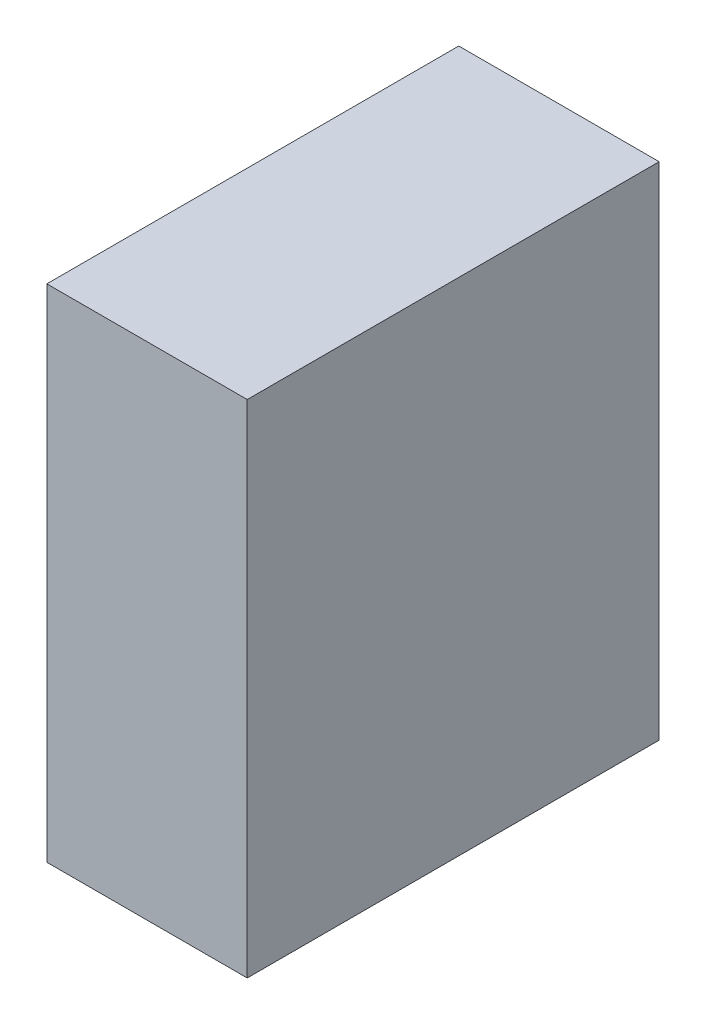
ISO-10303-21;
HEADER;
FILE_DESCRIPTION(('STEP AP214'),'2;1');
FILE_NAME('part.step','',(''),(''),'','','');
FILE_SCHEMA(('AUTOMOTIVE_DESIGN { 1 0 10303 214 1 1 1 1 }'));
ENDSEC;
DATA;
#1=APPLICATION_CONTEXT('core data for automotive mechanical design processes');
#2=APPLICATION_PROTOCOL_DEFINITION('international standard','automotive_design',2000,#1);
#3=PRODUCT_CONTEXT('',#1,'mechanical');
#4=PRODUCT('Part','Part','',(#3));
#5=PRODUCT_RELATED_PRODUCT_CATEGORY('part','',(#4));
#6=PRODUCT_DEFINITION_FORMATION('','',#4);
#7=PRODUCT_DEFINITION_CONTEXT('part definition',#1,'design');
#8=PRODUCT_DEFINITION('design','',#6,#7);
#9=PRODUCT_DEFINITION_SHAPE('','',#8);
#10=(LENGTH_UNIT() NAMED_UNIT(*) SI_UNIT(.MILLI.,.METRE.));
#11=(NAMED_UNIT(*) PLANE_ANGLE_UNIT() SI_UNIT($,.RADIAN.));
#12=(NAMED_UNIT(*) SI_UNIT($,.STERADIAN.) SOLID_ANGLE_UNIT());
#13=UNCERTAINTY_MEASURE_WITH_UNIT(LENGTH_MEASURE(1.E-05),#10,'distance_accuracy_value','');
#14=(GEOMETRIC_REPRESENTATION_CONTEXT(3) GLOBAL_UNCERTAINTY_ASSIGNED_CONTEXT((#13)) GLOBAL_UNIT_ASSIGNED_CONTEXT((#10,
#11,#12)) REPRESENTATION_CONTEXT('',''));
#15=CARTESIAN_POINT('',(0.,0.,0.));
#16=DIRECTION('',(0.,0.,1.));
#17=DIRECTION('',(1.,0.,0.));
#18=AXIS2_PLACEMENT_3D('',#15,#16,#17);
#19=CARTESIAN_POINT('',(90.,450.,185.));
#20=DIRECTION('',(-1.,0.,0.));
#21=DIRECTION('',(0.,0.,1.));
#22=AXIS2_PLACEMENT_3D('',#19,#20,#21);
#23=PLANE('',#22);
#24=DIRECTION('',(0.,0.,-1.));
#25=VECTOR('',#24,1.);
#26=CARTESIAN_POINT('',(90.,0.,185.));
#27=LINE('',#26,#25);
#28=CARTESIAN_POINT('',(90.,0.,185.));
#29=VERTEX_POINT('',#28);
#30=CARTESIAN_POINT('',(90.,0.,-185.));
#31=VERTEX_POINT('',#30);
#32=EDGE_CURVE('E107',#29,#31,#27,.T.);
#33=ORIENTED_EDGE('',*,*,#32,.T.);
#34=DIRECTION('',(0.,-1.,0.));
#35=VECTOR('',#34,1.);
#36=CARTESIAN_POINT('',(90.,450.,-185.));
#37=LINE('',#36,#35);
#38=CARTESIAN_POINT('',(90.,450.,-185.));
#39=VERTEX_POINT('',#38);
#40=EDGE_CURVE('E11',#39,#31,#37,.T.);
#41=ORIENTED_EDGE('',*,*,#40,.F.);
#42=DIRECTION('',(0.,0.,-1.));
#43=VECTOR('',#42,1.);
#44=CARTESIAN_POINT('',(90.,450.,185.));
#45=LINE('',#44,#43);
#46=CARTESIAN_POINT('',(90.,450.,185.));
#47=VERTEX_POINT('',#46);
#48=EDGE_CURVE('E91',#47,#39,#45,.T.);
#49=ORIENTED_EDGE('',*,*,#48,.F.);
#50=DIRECTION('',(0.,-1.,0.));
#51=VECTOR('',#50,1.);
#52=CARTESIAN_POINT('',(90.,450.,185.));
#53=LINE('',#52,#51);
#54=EDGE_CURVE('E103',#47,#29,#53,.T.);
#55=ORIENTED_EDGE('',*,*,#54,.T.);
#56=EDGE_LOOP('',(#33,#41,#49,#55));
#57=FACE_BOUND('',#56,.T.);
#58=ADVANCED_FACE('F39',(#57),#23,.F.);
#59=CARTESIAN_POINT('',(-90.,450.,-185.));
#60=DIRECTION('',(0.,0.,1.));
#61=DIRECTION('',(1.,0.,0.));
#62=AXIS2_PLACEMENT_3D('',#59,#60,#61);
#63=PLANE('',#62);
#64=DIRECTION('',(-1.,0.,0.));
#65=VECTOR('',#64,1.);
#66=CARTESIAN_POINT('',(-90.,0.,-185.));
#67=LINE('',#66,#65);
#68=CARTESIAN_POINT('',(-90.,0.,-185.));
#69=VERTEX_POINT('',#68);
#70=EDGE_CURVE('E96',#31,#69,#67,.T.);
#71=ORIENTED_EDGE('',*,*,#70,.T.);
#72=DIRECTION('',(0.,-1.,0.));
#73=VECTOR('',#72,1.);
#74=CARTESIAN_POINT('',(-90.,450.,-185.));
#75=LINE('',#74,#73);
#76=CARTESIAN_POINT('',(-90.,450.,-185.));
#77=VERTEX_POINT('',#76);
#78=EDGE_CURVE('E48',#77,#69,#75,.T.);
#79=ORIENTED_EDGE('',*,*,#78,.F.);
#80=DIRECTION('',(-1.,0.,0.));
#81=VECTOR('',#80,1.);
#82=CARTESIAN_POINT('',(-90.,450.,-185.));
#83=LINE('',#82,#81);
#84=EDGE_CURVE('E86',#39,#77,#83,.T.);
#85=ORIENTED_EDGE('',*,*,#84,.F.);
#86=ORIENTED_EDGE('',*,*,#40,.T.);
#87=EDGE_LOOP('',(#71,#79,#85,#86));
#88=FACE_BOUND('',#87,.T.);
#89=ADVANCED_FACE('F95',(#88),#63,.F.);
#90=CARTESIAN_POINT('',(-90.,450.,185.));
#91=DIRECTION('',(1.,0.,0.));
#92=DIRECTION('',(0.,0.,-1.));
#93=AXIS2_PLACEMENT_3D('',#90,#91,#92);
#94=PLANE('',#93);
#95=DIRECTION('',(0.,0.,1.));
#96=VECTOR('',#95,1.);
#97=CARTESIAN_POINT('',(-90.,0.,185.));
#98=LINE('',#97,#96);
#99=CARTESIAN_POINT('',(-90.,0.,185.));
#100=VERTEX_POINT('',#99);
#101=EDGE_CURVE('E73',#69,#100,#98,.T.);
#102=ORIENTED_EDGE('',*,*,#101,.T.);
#103=DIRECTION('',(0.,-1.,0.));
#104=VECTOR('',#103,1.);
#105=CARTESIAN_POINT('',(-90.,450.,185.));
#106=LINE('',#105,#104);
#107=CARTESIAN_POINT('',(-90.,450.,185.));
#108=VERTEX_POINT('',#107);
#109=EDGE_CURVE('E98',#108,#100,#106,.T.);
#110=ORIENTED_EDGE('',*,*,#109,.F.);
#111=DIRECTION('',(0.,0.,1.));
#112=VECTOR('',#111,1.);
#113=CARTESIAN_POINT('',(-90.,450.,185.));
#114=LINE('',#113,#112);
#115=EDGE_CURVE('E89',#77,#108,#114,.T.);
#116=ORIENTED_EDGE('',*,*,#115,.F.);
#117=ORIENTED_EDGE('',*,*,#78,.T.);
#118=EDGE_LOOP('',(#102,#110,#116,#117));
#119=FACE_BOUND('',#118,.T.);
#120=ADVANCED_FACE('F99',(#119),#94,.F.);
#121=CARTESIAN_POINT('',(-90.,450.,185.));
#122=DIRECTION('',(0.,0.,-1.));
#123=DIRECTION('',(-1.,0.,0.));
#124=AXIS2_PLACEMENT_3D('',#121,#122,#123);
#125=PLANE('',#124);
#126=DIRECTION('',(1.,0.,0.));
#127=VECTOR('',#126,1.);
#128=CARTESIAN_POINT('',(-90.,0.,185.));
#129=LINE('',#128,#127);
#130=EDGE_CURVE('E79',#100,#29,#129,.T.);
#131=ORIENTED_EDGE('',*,*,#130,.T.);
#132=ORIENTED_EDGE('',*,*,#54,.F.);
#133=DIRECTION('',(1.,0.,0.));
#134=VECTOR('',#133,1.);
#135=CARTESIAN_POINT('',(-90.,450.,185.));
#136=LINE('',#135,#134);
#137=EDGE_CURVE('E56',#108,#47,#136,.T.);
#138=ORIENTED_EDGE('',*,*,#137,.F.);
#139=ORIENTED_EDGE('',*,*,#109,.T.);
#140=EDGE_LOOP('',(#131,#132,#138,#139));
#141=FACE_BOUND('',#140,.T.);
#142=ADVANCED_FACE('F120',(#141),#125,.F.);
#143=CARTESIAN_POINT('',(0.,450.,0.));
#144=DIRECTION('',(0.,-1.,0.));
#145=DIRECTION('',(0.,0.,-1.));
#146=AXIS2_PLACEMENT_3D('',#143,#144,#145);
#147=PLANE('',#146);
#148=ORIENTED_EDGE('',*,*,#48,.T.);
#149=ORIENTED_EDGE('',*,*,#84,.T.);
#150=ORIENTED_EDGE('',*,*,#115,.T.);
#151=ORIENTED_EDGE('',*,*,#137,.T.);
#152=EDGE_LOOP('',(#148,#149,#150,#151));
#153=FACE_BOUND('',#152,.T.);
#154=ADVANCED_FACE('F87',(#153),#147,.F.);
#155=CARTESIAN_POINT('',(0.,0.,0.));
#156=DIRECTION('',(0.,-1.,0.));
#157=DIRECTION('',(0.,0.,-1.));
#158=AXIS2_PLACEMENT_3D('',#155,#156,#157);
#159=PLANE('',#158);
#160=ORIENTED_EDGE('',*,*,#32,.F.);
#161=ORIENTED_EDGE('',*,*,#130,.F.);
#162=ORIENTED_EDGE('',*,*,#101,.F.);
#163=ORIENTED_EDGE('',*,*,#70,.F.);
#164=EDGE_LOOP('',(#160,#161,#162,#163));
#165=FACE_BOUND('',#164,.T.);
#166=ADVANCED_FACE('F123',(#165),#159,.T.);
#167=CLOSED_SHELL('',(#58,#89,#120,#142,#154,#166));
#168=MANIFOLD_SOLID_BREP('B2',#167);
#169=ADVANCED_BREP_SHAPE_REPRESENTATION('',(#18,#168),#14);
#170=SHAPE_DEFINITION_REPRESENTATION(#9,#169);
ENDSEC;
END-ISO-10303-21;
